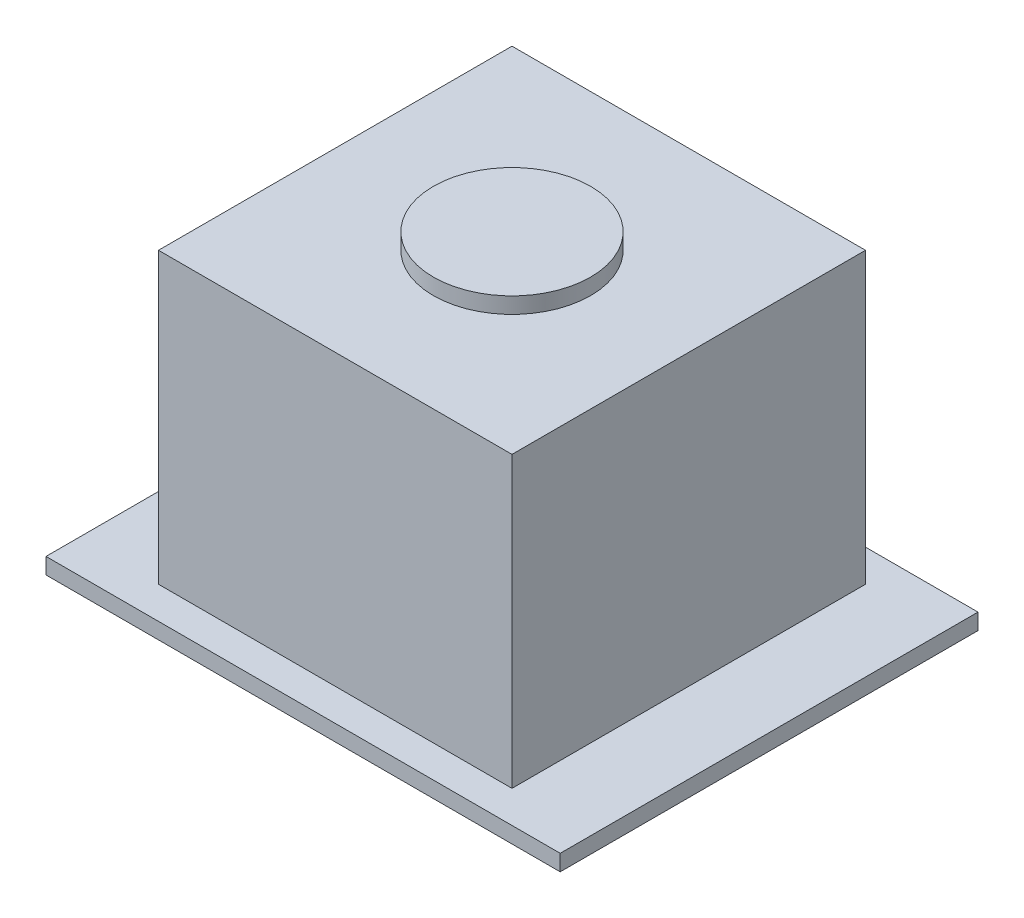
ISO-10303-21;
HEADER;
FILE_DESCRIPTION(('STEP AP214'),'2;1');
FILE_NAME('part.step','',(''),(''),'','','');
FILE_SCHEMA(('AUTOMOTIVE_DESIGN { 1 0 10303 214 1 1 1 1 }'));
ENDSEC;
DATA;
#1=APPLICATION_CONTEXT('core data for automotive mechanical design processes');
#2=APPLICATION_PROTOCOL_DEFINITION('international standard','automotive_design',2000,#1);
#3=PRODUCT_CONTEXT('',#1,'mechanical');
#4=PRODUCT('Part','Part','',(#3));
#5=PRODUCT_RELATED_PRODUCT_CATEGORY('part','',(#4));
#6=PRODUCT_DEFINITION_FORMATION('','',#4);
#7=PRODUCT_DEFINITION_CONTEXT('part definition',#1,'design');
#8=PRODUCT_DEFINITION('design','',#6,#7);
#9=PRODUCT_DEFINITION_SHAPE('','',#8);
#10=(LENGTH_UNIT() NAMED_UNIT(*) SI_UNIT(.MILLI.,.METRE.));
#11=(NAMED_UNIT(*) PLANE_ANGLE_UNIT() SI_UNIT($,.RADIAN.));
#12=(NAMED_UNIT(*) SI_UNIT($,.STERADIAN.) SOLID_ANGLE_UNIT());
#13=UNCERTAINTY_MEASURE_WITH_UNIT(LENGTH_MEASURE(1.E-05),#10,'distance_accuracy_value','');
#14=(GEOMETRIC_REPRESENTATION_CONTEXT(3) GLOBAL_UNCERTAINTY_ASSIGNED_CONTEXT((#13)) GLOBAL_UNIT_ASSIGNED_CONTEXT((#10,
#11,#12)) REPRESENTATION_CONTEXT('',''));
#15=CARTESIAN_POINT('',(0.,0.,0.));
#16=DIRECTION('',(0.,0.,1.));
#17=DIRECTION('',(1.,0.,0.));
#18=AXIS2_PLACEMENT_3D('',#15,#16,#17);
#19=CARTESIAN_POINT('',(132.976530612245,9.,96.6260204081633));
#20=DIRECTION('',(1.,0.,0.));
#21=DIRECTION('',(0.,0.,-1.));
#22=AXIS2_PLACEMENT_3D('',#19,#20,#21);
#23=PLANE('',#22);
#24=DIRECTION('',(0.,0.,1.));
#25=VECTOR('',#24,1.);
#26=CARTESIAN_POINT('',(132.976530612245,0.,96.6260204081633));
#27=LINE('',#26,#25);
#28=CARTESIAN_POINT('',(132.976530612245,0.,96.6260204081633));
#29=VERTEX_POINT('',#28);
#30=CARTESIAN_POINT('',(132.976530612245,0.,107.626020408163));
#31=VERTEX_POINT('',#30);
#32=EDGE_CURVE('E127',#29,#31,#27,.T.);
#33=ORIENTED_EDGE('',*,*,#32,.T.);
#34=DIRECTION('',(0.,-1.,0.));
#35=VECTOR('',#34,1.);
#36=CARTESIAN_POINT('',(132.976530612245,9.,107.626020408163));
#37=LINE('',#36,#35);
#38=CARTESIAN_POINT('',(132.976530612245,9.,107.626020408163));
#39=VERTEX_POINT('',#38);
#40=EDGE_CURVE('E44',#39,#31,#37,.T.);
#41=ORIENTED_EDGE('',*,*,#40,.F.);
#42=DIRECTION('',(0.,0.,1.));
#43=VECTOR('',#42,1.);
#44=CARTESIAN_POINT('',(132.976530612245,9.,96.6260204081633));
#45=LINE('',#44,#43);
#46=CARTESIAN_POINT('',(132.976530612245,9.,96.6260204081633));
#47=VERTEX_POINT('',#46);
#48=EDGE_CURVE('E136',#47,#39,#45,.T.);
#49=ORIENTED_EDGE('',*,*,#48,.F.);
#50=DIRECTION('',(0.,-1.,0.));
#51=VECTOR('',#50,1.);
#52=CARTESIAN_POINT('',(132.976530612245,9.,96.6260204081633));
#53=LINE('',#52,#51);
#54=EDGE_CURVE('E143',#47,#29,#53,.T.);
#55=ORIENTED_EDGE('',*,*,#54,.T.);
#56=EDGE_LOOP('',(#33,#41,#49,#55));
#57=FACE_BOUND('',#56,.T.);
#58=ADVANCED_FACE('F41',(#57),#23,.F.);
#59=CARTESIAN_POINT('',(132.976530612245,9.,107.626020408163));
#60=DIRECTION('',(0.,0.,-1.));
#61=DIRECTION('',(-1.,0.,0.));
#62=AXIS2_PLACEMENT_3D('',#59,#60,#61);
#63=PLANE('',#62);
#64=DIRECTION('',(1.,0.,0.));
#65=VECTOR('',#64,1.);
#66=CARTESIAN_POINT('',(132.976530612245,0.,107.626020408163));
#67=LINE('',#66,#65);
#68=CARTESIAN_POINT('',(143.976530612245,0.,107.626020408163));
#69=VERTEX_POINT('',#68);
#70=EDGE_CURVE('E130',#31,#69,#67,.T.);
#71=ORIENTED_EDGE('',*,*,#70,.T.);
#72=DIRECTION('',(0.,-1.,0.));
#73=VECTOR('',#72,1.);
#74=CARTESIAN_POINT('',(143.976530612245,9.,107.626020408163));
#75=LINE('',#74,#73);
#76=CARTESIAN_POINT('',(143.976530612245,9.,107.626020408163));
#77=VERTEX_POINT('',#76);
#78=EDGE_CURVE('E156',#77,#69,#75,.T.);
#79=ORIENTED_EDGE('',*,*,#78,.F.);
#80=DIRECTION('',(1.,0.,0.));
#81=VECTOR('',#80,1.);
#82=CARTESIAN_POINT('',(132.976530612245,9.,107.626020408163));
#83=LINE('',#82,#81);
#84=EDGE_CURVE('E138',#39,#77,#83,.T.);
#85=ORIENTED_EDGE('',*,*,#84,.F.);
#86=ORIENTED_EDGE('',*,*,#40,.T.);
#87=EDGE_LOOP('',(#71,#79,#85,#86));
#88=FACE_BOUND('',#87,.T.);
#89=ADVANCED_FACE('F164',(#88),#63,.F.);
#90=CARTESIAN_POINT('',(143.976530612245,9.,96.6260204081633));
#91=DIRECTION('',(-1.,0.,0.));
#92=DIRECTION('',(0.,0.,1.));
#93=AXIS2_PLACEMENT_3D('',#90,#91,#92);
#94=PLANE('',#93);
#95=DIRECTION('',(0.,0.,-1.));
#96=VECTOR('',#95,1.);
#97=CARTESIAN_POINT('',(143.976530612245,0.,96.6260204081633));
#98=LINE('',#97,#96);
#99=CARTESIAN_POINT('',(143.976530612245,0.,96.6260204081633));
#100=VERTEX_POINT('',#99);
#101=EDGE_CURVE('E147',#69,#100,#98,.T.);
#102=ORIENTED_EDGE('',*,*,#101,.T.);
#103=DIRECTION('',(0.,-1.,0.));
#104=VECTOR('',#103,1.);
#105=CARTESIAN_POINT('',(143.976530612245,9.,96.6260204081633));
#106=LINE('',#105,#104);
#107=CARTESIAN_POINT('',(143.976530612245,9.,96.6260204081633));
#108=VERTEX_POINT('',#107);
#109=EDGE_CURVE('E154',#108,#100,#106,.T.);
#110=ORIENTED_EDGE('',*,*,#109,.F.);
#111=DIRECTION('',(0.,0.,-1.));
#112=VECTOR('',#111,1.);
#113=CARTESIAN_POINT('',(143.976530612245,9.,96.6260204081633));
#114=LINE('',#113,#112);
#115=EDGE_CURVE('E141',#77,#108,#114,.T.);
#116=ORIENTED_EDGE('',*,*,#115,.F.);
#117=ORIENTED_EDGE('',*,*,#78,.T.);
#118=EDGE_LOOP('',(#102,#110,#116,#117));
#119=FACE_BOUND('',#118,.T.);
#120=ADVANCED_FACE('F174',(#119),#94,.F.);
#121=CARTESIAN_POINT('',(132.976530612245,9.,96.6260204081633));
#122=DIRECTION('',(0.,0.,1.));
#123=DIRECTION('',(1.,0.,0.));
#124=AXIS2_PLACEMENT_3D('',#121,#122,#123);
#125=PLANE('',#124);
#126=DIRECTION('',(-1.,0.,0.));
#127=VECTOR('',#126,1.);
#128=CARTESIAN_POINT('',(132.976530612245,0.,96.6260204081633));
#129=LINE('',#128,#127);
#130=EDGE_CURVE('E139',#100,#29,#129,.T.);
#131=ORIENTED_EDGE('',*,*,#130,.T.);
#132=ORIENTED_EDGE('',*,*,#54,.F.);
#133=DIRECTION('',(-1.,0.,0.));
#134=VECTOR('',#133,1.);
#135=CARTESIAN_POINT('',(132.976530612245,9.,96.6260204081633));
#136=LINE('',#135,#134);
#137=EDGE_CURVE('E57',#108,#47,#136,.T.);
#138=ORIENTED_EDGE('',*,*,#137,.F.);
#139=ORIENTED_EDGE('',*,*,#109,.T.);
#140=EDGE_LOOP('',(#131,#132,#138,#139));
#141=FACE_BOUND('',#140,.T.);
#142=ADVANCED_FACE('F172',(#141),#125,.F.);
#143=CARTESIAN_POINT('',(0.,9.,0.));
#144=DIRECTION('',(0.,1.,0.));
#145=DIRECTION('',(0.,0.,1.));
#146=AXIS2_PLACEMENT_3D('',#143,#144,#145);
#147=PLANE('',#146);
#148=CARTESIAN_POINT('',(138.476530612245,9.,102.126020408163));
#149=DIRECTION('',(0.,1.,0.));
#150=DIRECTION('',(0.,0.,1.));
#151=AXIS2_PLACEMENT_3D('',#148,#149,#150);
#152=CIRCLE('',#151,2.44658702742082);
#153=CARTESIAN_POINT('',(138.476530612245,9.,104.572607435584));
#154=VERTEX_POINT('',#153);
#155=EDGE_CURVE('E11',#154,#154,#152,.T.);
#156=ORIENTED_EDGE('',*,*,#155,.F.);
#157=EDGE_LOOP('',(#156));
#158=FACE_BOUND('',#157,.T.);
#159=ORIENTED_EDGE('',*,*,#48,.T.);
#160=ORIENTED_EDGE('',*,*,#84,.T.);
#161=ORIENTED_EDGE('',*,*,#115,.T.);
#162=ORIENTED_EDGE('',*,*,#137,.T.);
#163=EDGE_LOOP('',(#159,#160,#161,#162));
#164=FACE_BOUND('',#163,.T.);
#165=ADVANCED_FACE('F175',(#158,#164),#147,.T.);
#166=CARTESIAN_POINT('',(130.476530612245,-0.5,108.626020408163));
#167=DIRECTION('',(1.,0.,0.));
#168=DIRECTION('',(0.,0.,-1.));
#169=AXIS2_PLACEMENT_3D('',#166,#167,#168);
#170=PLANE('',#169);
#171=DIRECTION('',(0.,0.,-1.));
#172=VECTOR('',#171,1.);
#173=CARTESIAN_POINT('',(130.476530612245,0.,108.626020408163));
#174=LINE('',#173,#172);
#175=CARTESIAN_POINT('',(130.476530612245,0.,108.626020408163));
#176=VERTEX_POINT('',#175);
#177=CARTESIAN_POINT('',(130.476530612245,0.,95.6260204081633));
#178=VERTEX_POINT('',#177);
#179=EDGE_CURVE('E126',#176,#178,#174,.T.);
#180=ORIENTED_EDGE('',*,*,#179,.T.);
#181=DIRECTION('',(0.,1.,0.));
#182=VECTOR('',#181,1.);
#183=CARTESIAN_POINT('',(130.476530612245,-0.5,95.6260204081633));
#184=LINE('',#183,#182);
#185=CARTESIAN_POINT('',(130.476530612245,-0.5,95.6260204081633));
#186=VERTEX_POINT('',#185);
#187=EDGE_CURVE('E106',#186,#178,#184,.T.);
#188=ORIENTED_EDGE('',*,*,#187,.F.);
#189=DIRECTION('',(0.,0.,-1.));
#190=VECTOR('',#189,1.);
#191=CARTESIAN_POINT('',(130.476530612245,-0.5,108.626020408163));
#192=LINE('',#191,#190);
#193=CARTESIAN_POINT('',(130.476530612245,-0.5,108.626020408163));
#194=VERTEX_POINT('',#193);
#195=EDGE_CURVE('E113',#194,#186,#192,.T.);
#196=ORIENTED_EDGE('',*,*,#195,.F.);
#197=DIRECTION('',(0.,1.,0.));
#198=VECTOR('',#197,1.);
#199=CARTESIAN_POINT('',(130.476530612245,-0.5,108.626020408163));
#200=LINE('',#199,#198);
#201=EDGE_CURVE('E277',#194,#176,#200,.T.);
#202=ORIENTED_EDGE('',*,*,#201,.T.);
#203=EDGE_LOOP('',(#180,#188,#196,#202));
#204=FACE_BOUND('',#203,.T.);
#205=ADVANCED_FACE('F124',(#204),#170,.F.);
#206=CARTESIAN_POINT('',(130.476530612245,-0.5,95.6260204081633));
#207=DIRECTION('',(0.,0.,1.));
#208=DIRECTION('',(1.,0.,0.));
#209=AXIS2_PLACEMENT_3D('',#206,#207,#208);
#210=PLANE('',#209);
#211=DIRECTION('',(1.,0.,0.));
#212=VECTOR('',#211,1.);
#213=CARTESIAN_POINT('',(130.476530612245,0.,95.6260204081633));
#214=LINE('',#213,#212);
#215=CARTESIAN_POINT('',(146.476530612245,0.,95.6260204081633));
#216=VERTEX_POINT('',#215);
#217=EDGE_CURVE('E273',#178,#216,#214,.T.);
#218=ORIENTED_EDGE('',*,*,#217,.T.);
#219=DIRECTION('',(0.,1.,0.));
#220=VECTOR('',#219,1.);
#221=CARTESIAN_POINT('',(146.476530612245,-0.5,95.6260204081633));
#222=LINE('',#221,#220);
#223=CARTESIAN_POINT('',(146.476530612245,-0.5,95.6260204081633));
#224=VERTEX_POINT('',#223);
#225=EDGE_CURVE('E109',#224,#216,#222,.T.);
#226=ORIENTED_EDGE('',*,*,#225,.F.);
#227=DIRECTION('',(1.,0.,0.));
#228=VECTOR('',#227,1.);
#229=CARTESIAN_POINT('',(130.476530612245,-0.5,95.6260204081633));
#230=LINE('',#229,#228);
#231=EDGE_CURVE('E102',#186,#224,#230,.T.);
#232=ORIENTED_EDGE('',*,*,#231,.F.);
#233=ORIENTED_EDGE('',*,*,#187,.T.);
#234=EDGE_LOOP('',(#218,#226,#232,#233));
#235=FACE_BOUND('',#234,.T.);
#236=ADVANCED_FACE('F104',(#235),#210,.F.);
#237=CARTESIAN_POINT('',(146.476530612245,-0.5,108.626020408163));
#238=DIRECTION('',(-1.,0.,0.));
#239=DIRECTION('',(0.,0.,1.));
#240=AXIS2_PLACEMENT_3D('',#237,#238,#239);
#241=PLANE('',#240);
#242=DIRECTION('',(0.,0.,1.));
#243=VECTOR('',#242,1.);
#244=CARTESIAN_POINT('',(146.476530612245,0.,108.626020408163));
#245=LINE('',#244,#243);
#246=CARTESIAN_POINT('',(146.476530612245,0.,108.626020408163));
#247=VERTEX_POINT('',#246);
#248=EDGE_CURVE('E280',#216,#247,#245,.T.);
#249=ORIENTED_EDGE('',*,*,#248,.T.);
#250=DIRECTION('',(0.,1.,0.));
#251=VECTOR('',#250,1.);
#252=CARTESIAN_POINT('',(146.476530612245,-0.5,108.626020408163));
#253=LINE('',#252,#251);
#254=CARTESIAN_POINT('',(146.476530612245,-0.5,108.626020408163));
#255=VERTEX_POINT('',#254);
#256=EDGE_CURVE('E132',#255,#247,#253,.T.);
#257=ORIENTED_EDGE('',*,*,#256,.F.);
#258=DIRECTION('',(0.,0.,1.));
#259=VECTOR('',#258,1.);
#260=CARTESIAN_POINT('',(146.476530612245,-0.5,108.626020408163));
#261=LINE('',#260,#259);
#262=EDGE_CURVE('E112',#224,#255,#261,.T.);
#263=ORIENTED_EDGE('',*,*,#262,.F.);
#264=ORIENTED_EDGE('',*,*,#225,.T.);
#265=EDGE_LOOP('',(#249,#257,#263,#264));
#266=FACE_BOUND('',#265,.T.);
#267=ADVANCED_FACE('F215',(#266),#241,.F.);
#268=CARTESIAN_POINT('',(130.476530612245,-0.5,108.626020408163));
#269=DIRECTION('',(0.,0.,-1.));
#270=DIRECTION('',(-1.,0.,0.));
#271=AXIS2_PLACEMENT_3D('',#268,#269,#270);
#272=PLANE('',#271);
#273=DIRECTION('',(-1.,0.,0.));
#274=VECTOR('',#273,1.);
#275=CARTESIAN_POINT('',(130.476530612245,0.,108.626020408163));
#276=LINE('',#275,#274);
#277=EDGE_CURVE('E122',#247,#176,#276,.T.);
#278=ORIENTED_EDGE('',*,*,#277,.T.);
#279=ORIENTED_EDGE('',*,*,#201,.F.);
#280=DIRECTION('',(-1.,0.,0.));
#281=VECTOR('',#280,1.);
#282=CARTESIAN_POINT('',(130.476530612245,-0.5,108.626020408163));
#283=LINE('',#282,#281);
#284=EDGE_CURVE('E118',#255,#194,#283,.T.);
#285=ORIENTED_EDGE('',*,*,#284,.F.);
#286=ORIENTED_EDGE('',*,*,#256,.T.);
#287=EDGE_LOOP('',(#278,#279,#285,#286));
#288=FACE_BOUND('',#287,.T.);
#289=ADVANCED_FACE('F223',(#288),#272,.F.);
#290=CARTESIAN_POINT('',(0.,-0.5,0.));
#291=DIRECTION('',(0.,-1.,0.));
#292=DIRECTION('',(0.,0.,-1.));
#293=AXIS2_PLACEMENT_3D('',#290,#291,#292);
#294=PLANE('',#293);
#295=ORIENTED_EDGE('',*,*,#195,.T.);
#296=ORIENTED_EDGE('',*,*,#231,.T.);
#297=ORIENTED_EDGE('',*,*,#262,.T.);
#298=ORIENTED_EDGE('',*,*,#284,.T.);
#299=EDGE_LOOP('',(#295,#296,#297,#298));
#300=FACE_BOUND('',#299,.T.);
#301=ADVANCED_FACE('F116',(#300),#294,.T.);
#302=CARTESIAN_POINT('',(0.,0.,0.));
#303=DIRECTION('',(0.,-1.,0.));
#304=DIRECTION('',(0.,0.,-1.));
#305=AXIS2_PLACEMENT_3D('',#302,#303,#304);
#306=PLANE('',#305);
#307=ORIENTED_EDGE('',*,*,#32,.F.);
#308=ORIENTED_EDGE('',*,*,#130,.F.);
#309=ORIENTED_EDGE('',*,*,#101,.F.);
#310=ORIENTED_EDGE('',*,*,#70,.F.);
#311=EDGE_LOOP('',(#307,#308,#309,#310));
#312=FACE_BOUND('',#311,.T.);
#313=ORIENTED_EDGE('',*,*,#179,.F.);
#314=ORIENTED_EDGE('',*,*,#277,.F.);
#315=ORIENTED_EDGE('',*,*,#248,.F.);
#316=ORIENTED_EDGE('',*,*,#217,.F.);
#317=EDGE_LOOP('',(#313,#314,#315,#316));
#318=FACE_BOUND('',#317,.T.);
#319=ADVANCED_FACE('F168',(#312,#318),#306,.F.);
#320=CARTESIAN_POINT('',(138.476530612245,9.5,102.126020408163));
#321=DIRECTION('',(0.,-1.,0.));
#322=DIRECTION('',(0.,0.,-1.));
#323=AXIS2_PLACEMENT_3D('',#320,#321,#322);
#324=CYLINDRICAL_SURFACE('',#323,2.44658702742082);
#325=CARTESIAN_POINT('',(138.476530612245,9.5,102.126020408163));
#326=DIRECTION('',(0.,1.,0.));
#327=DIRECTION('',(0.,0.,1.));
#328=AXIS2_PLACEMENT_3D('',#325,#326,#327);
#329=CIRCLE('',#328,2.44658702742082);
#330=CARTESIAN_POINT('',(138.476530612245,9.5,104.572607435584));
#331=VERTEX_POINT('',#330);
#332=EDGE_CURVE('E271',#331,#331,#329,.T.);
#333=ORIENTED_EDGE('',*,*,#332,.F.);
#334=EDGE_LOOP('',(#333));
#335=FACE_BOUND('',#334,.T.);
#336=ORIENTED_EDGE('',*,*,#155,.T.);
#337=EDGE_LOOP('',(#336));
#338=FACE_BOUND('',#337,.T.);
#339=ADVANCED_FACE('F245',(#335,#338),#324,.T.);
#340=CARTESIAN_POINT('',(138.476530612245,9.5,102.126020408163));
#341=DIRECTION('',(0.,1.,0.));
#342=DIRECTION('',(0.,0.,1.));
#343=AXIS2_PLACEMENT_3D('',#340,#341,#342);
#344=PLANE('',#343);
#345=ORIENTED_EDGE('',*,*,#332,.T.);
#346=EDGE_LOOP('',(#345));
#347=FACE_BOUND('',#346,.T.);
#348=ADVANCED_FACE('F256',(#347),#344,.T.);
#349=CLOSED_SHELL('',(#58,#89,#120,#142,#165,#205,#236,#267,#289,#301,#319,#339,#348));
#350=MANIFOLD_SOLID_BREP('B2',#349);
#351=ADVANCED_BREP_SHAPE_REPRESENTATION('',(#18,#350),#14);
#352=SHAPE_DEFINITION_REPRESENTATION(#9,#351);
ENDSEC;
END-ISO-10303-21;
